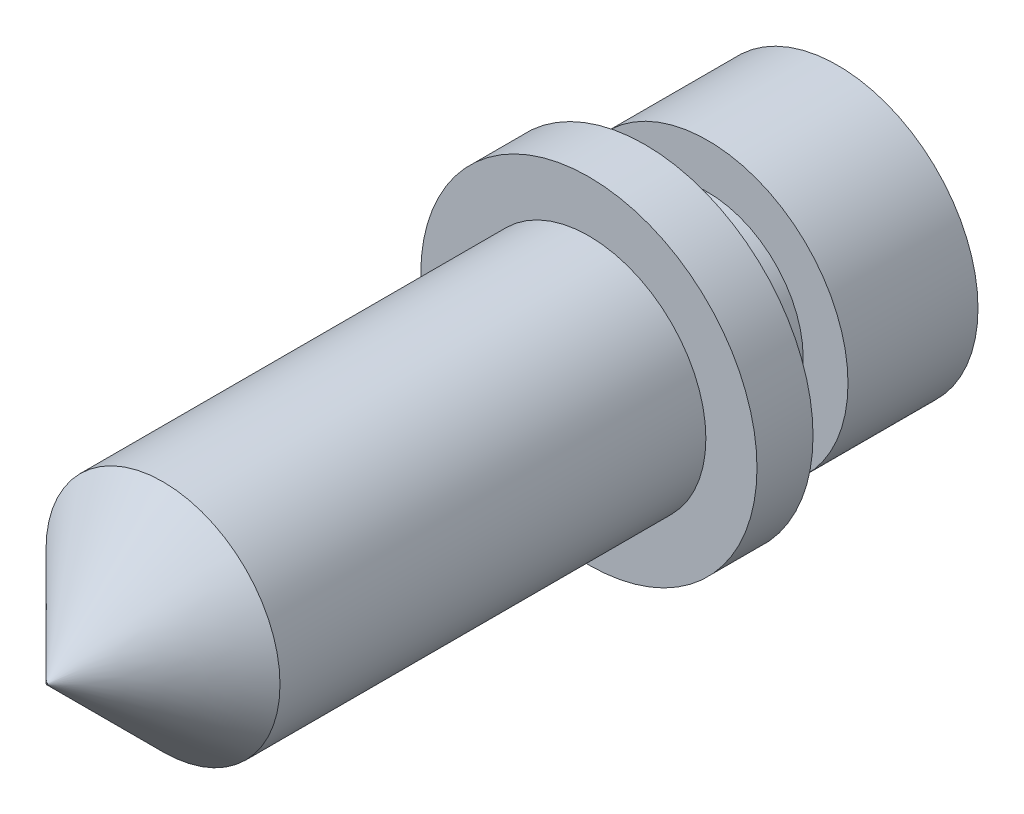
ISO-10303-21;
HEADER;
FILE_DESCRIPTION(('STEP AP214'),'2;1');
FILE_NAME('part.step','',(''),(''),'','','');
FILE_SCHEMA(('AUTOMOTIVE_DESIGN { 1 0 10303 214 1 1 1 1 }'));
ENDSEC;
DATA;
#1=APPLICATION_CONTEXT('core data for automotive mechanical design processes');
#2=APPLICATION_PROTOCOL_DEFINITION('international standard','automotive_design',2000,#1);
#3=PRODUCT_CONTEXT('',#1,'mechanical');
#4=PRODUCT('Part','Part','',(#3));
#5=PRODUCT_RELATED_PRODUCT_CATEGORY('part','',(#4));
#6=PRODUCT_DEFINITION_FORMATION('','',#4);
#7=PRODUCT_DEFINITION_CONTEXT('part definition',#1,'design');
#8=PRODUCT_DEFINITION('design','',#6,#7);
#9=PRODUCT_DEFINITION_SHAPE('','',#8);
#10=(LENGTH_UNIT() NAMED_UNIT(*) SI_UNIT(.MILLI.,.METRE.));
#11=(NAMED_UNIT(*) PLANE_ANGLE_UNIT() SI_UNIT($,.RADIAN.));
#12=(NAMED_UNIT(*) SI_UNIT($,.STERADIAN.) SOLID_ANGLE_UNIT());
#13=UNCERTAINTY_MEASURE_WITH_UNIT(LENGTH_MEASURE(1.E-05),#10,'distance_accuracy_value','');
#14=(GEOMETRIC_REPRESENTATION_CONTEXT(3) GLOBAL_UNCERTAINTY_ASSIGNED_CONTEXT((#13)) GLOBAL_UNIT_ASSIGNED_CONTEXT((#10,
#11,#12)) REPRESENTATION_CONTEXT('',''));
#15=CARTESIAN_POINT('',(0.,0.,0.));
#16=DIRECTION('',(0.,0.,1.));
#17=DIRECTION('',(1.,0.,0.));
#18=AXIS2_PLACEMENT_3D('',#15,#16,#17);
#19=CARTESIAN_POINT('',(0.,0.,12.85875));
#20=DIRECTION('',(0.,0.,-1.));
#21=DIRECTION('',(-1.,0.,0.));
#22=AXIS2_PLACEMENT_3D('',#19,#20,#21);
#23=CONICAL_SURFACE('',#22,3.3147,0.785398163397453);
#24=CARTESIAN_POINT('',(0.,0.,12.85875));
#25=DIRECTION('',(0.,0.,1.));
#26=DIRECTION('',(1.,0.,0.));
#27=AXIS2_PLACEMENT_3D('',#24,#25,#26);
#28=CIRCLE('',#27,3.3147);
#29=CARTESIAN_POINT('',(3.3147,0.,12.85875));
#30=VERTEX_POINT('',#29);
#31=EDGE_CURVE('E48',#30,#30,#28,.T.);
#32=ORIENTED_EDGE('',*,*,#31,.T.);
#33=EDGE_LOOP('',(#32));
#34=FACE_BOUND('',#33,.T.);
#35=CARTESIAN_POINT('',(0.,0.,16.14805));
#36=DIRECTION('',(0.,0.,1.));
#37=DIRECTION('',(1.,0.,0.));
#38=AXIS2_PLACEMENT_3D('',#35,#36,#37);
#39=CIRCLE('',#38,0.0253999999999992);
#40=CARTESIAN_POINT('',(0.0253999999999992,0.,16.14805));
#41=VERTEX_POINT('',#40);
#42=EDGE_CURVE('E35',#41,#41,#39,.F.);
#43=ORIENTED_EDGE('',*,*,#42,.T.);
#44=EDGE_LOOP('',(#43));
#45=FACE_BOUND('',#44,.T.);
#46=ADVANCED_FACE('F31',(#34,#45),#23,.T.);
#47=CARTESIAN_POINT('',(0.,0.,0.79375));
#48=DIRECTION('',(0.,0.,1.));
#49=DIRECTION('',(1.,0.,0.));
#50=AXIS2_PLACEMENT_3D('',#47,#48,#49);
#51=PLANE('',#50);
#52=CARTESIAN_POINT('',(0.,0.,0.79375));
#53=DIRECTION('',(0.,0.,1.));
#54=DIRECTION('',(1.,0.,0.));
#55=AXIS2_PLACEMENT_3D('',#52,#53,#54);
#56=CIRCLE('',#55,4.7625);
#57=CARTESIAN_POINT('',(4.7625,0.,0.79375));
#58=VERTEX_POINT('',#57);
#59=EDGE_CURVE('E10',#58,#58,#56,.T.);
#60=ORIENTED_EDGE('',*,*,#59,.T.);
#61=EDGE_LOOP('',(#60));
#62=FACE_BOUND('',#61,.T.);
#63=CARTESIAN_POINT('',(0.,0.,0.79375));
#64=DIRECTION('',(0.,0.,1.));
#65=DIRECTION('',(1.,0.,0.));
#66=AXIS2_PLACEMENT_3D('',#63,#64,#65);
#67=CIRCLE('',#66,3.3147);
#68=CARTESIAN_POINT('',(3.3147,0.,0.79375));
#69=VERTEX_POINT('',#68);
#70=EDGE_CURVE('E49',#69,#69,#67,.T.);
#71=ORIENTED_EDGE('',*,*,#70,.F.);
#72=EDGE_LOOP('',(#71));
#73=FACE_BOUND('',#72,.T.);
#74=ADVANCED_FACE('F89',(#62,#73),#51,.T.);
#75=CARTESIAN_POINT('',(0.,0.,-0.79375));
#76=DIRECTION('',(0.,0.,1.));
#77=DIRECTION('',(1.,0.,0.));
#78=AXIS2_PLACEMENT_3D('',#75,#76,#77);
#79=PLANE('',#78);
#80=CARTESIAN_POINT('',(0.,0.,-0.79375));
#81=DIRECTION('',(0.,0.,1.));
#82=DIRECTION('',(1.,0.,0.));
#83=AXIS2_PLACEMENT_3D('',#80,#81,#82);
#84=CIRCLE('',#83,4.7625);
#85=CARTESIAN_POINT('',(4.7625,0.,-0.79375));
#86=VERTEX_POINT('',#85);
#87=EDGE_CURVE('E39',#86,#86,#84,.T.);
#88=ORIENTED_EDGE('',*,*,#87,.F.);
#89=EDGE_LOOP('',(#88));
#90=FACE_BOUND('',#89,.T.);
#91=CARTESIAN_POINT('',(0.,0.,-0.79375));
#92=DIRECTION('',(0.,0.,1.));
#93=DIRECTION('',(1.,0.,0.));
#94=AXIS2_PLACEMENT_3D('',#91,#92,#93);
#95=CIRCLE('',#94,2.7051);
#96=CARTESIAN_POINT('',(2.7051,0.,-0.79375));
#97=VERTEX_POINT('',#96);
#98=EDGE_CURVE('E66',#97,#97,#95,.T.);
#99=ORIENTED_EDGE('',*,*,#98,.T.);
#100=EDGE_LOOP('',(#99));
#101=FACE_BOUND('',#100,.T.);
#102=ADVANCED_FACE('F95',(#90,#101),#79,.F.);
#103=CARTESIAN_POINT('',(0.,0.,0.79375));
#104=DIRECTION('',(0.,0.,-1.));
#105=DIRECTION('',(-1.,0.,0.));
#106=AXIS2_PLACEMENT_3D('',#103,#104,#105);
#107=CYLINDRICAL_SURFACE('',#106,4.7625);
#108=ORIENTED_EDGE('',*,*,#59,.F.);
#109=EDGE_LOOP('',(#108));
#110=FACE_BOUND('',#109,.T.);
#111=ORIENTED_EDGE('',*,*,#87,.T.);
#112=EDGE_LOOP('',(#111));
#113=FACE_BOUND('',#112,.T.);
#114=ADVANCED_FACE('F33',(#110,#113),#107,.T.);
#115=CARTESIAN_POINT('',(0.,0.,12.85875));
#116=DIRECTION('',(0.,0.,-1.));
#117=DIRECTION('',(-1.,0.,0.));
#118=AXIS2_PLACEMENT_3D('',#115,#116,#117);
#119=CYLINDRICAL_SURFACE('',#118,3.3147);
#120=ORIENTED_EDGE('',*,*,#31,.F.);
#121=EDGE_LOOP('',(#120));
#122=FACE_BOUND('',#121,.T.);
#123=ORIENTED_EDGE('',*,*,#70,.T.);
#124=EDGE_LOOP('',(#123));
#125=FACE_BOUND('',#124,.T.);
#126=ADVANCED_FACE('F102',(#122,#125),#119,.T.);
#127=CARTESIAN_POINT('',(-3.9751,0.,-2.57175));
#128=DIRECTION('',(0.,0.,1.));
#129=DIRECTION('',(1.,0.,0.));
#130=AXIS2_PLACEMENT_3D('',#127,#128,#129);
#131=PLANE('',#130);
#132=CARTESIAN_POINT('',(0.,0.,-2.57175));
#133=DIRECTION('',(0.,0.,1.));
#134=DIRECTION('',(1.,0.,0.));
#135=AXIS2_PLACEMENT_3D('',#132,#133,#134);
#136=CIRCLE('',#135,3.9751);
#137=CARTESIAN_POINT('',(3.9751,0.,-2.57175));
#138=VERTEX_POINT('',#137);
#139=EDGE_CURVE('E58',#138,#138,#136,.T.);
#140=ORIENTED_EDGE('',*,*,#139,.T.);
#141=EDGE_LOOP('',(#140));
#142=FACE_BOUND('',#141,.T.);
#143=CARTESIAN_POINT('',(0.,0.,-2.57175));
#144=DIRECTION('',(0.,0.,1.));
#145=DIRECTION('',(1.,0.,0.));
#146=AXIS2_PLACEMENT_3D('',#143,#144,#145);
#147=CIRCLE('',#146,2.7051);
#148=CARTESIAN_POINT('',(2.7051,0.,-2.57175));
#149=VERTEX_POINT('',#148);
#150=EDGE_CURVE('E63',#149,#149,#147,.T.);
#151=ORIENTED_EDGE('',*,*,#150,.F.);
#152=EDGE_LOOP('',(#151));
#153=FACE_BOUND('',#152,.T.);
#154=ADVANCED_FACE('F105',(#142,#153),#131,.T.);
#155=CARTESIAN_POINT('',(0.,0.,0.));
#156=DIRECTION('',(0.,0.,1.));
#157=DIRECTION('',(1.,0.,0.));
#158=AXIS2_PLACEMENT_3D('',#155,#156,#157);
#159=CYLINDRICAL_SURFACE('',#158,2.7051);
#160=ORIENTED_EDGE('',*,*,#150,.T.);
#161=EDGE_LOOP('',(#160));
#162=FACE_BOUND('',#161,.T.);
#163=ORIENTED_EDGE('',*,*,#98,.F.);
#164=EDGE_LOOP('',(#163));
#165=FACE_BOUND('',#164,.T.);
#166=ADVANCED_FACE('F123',(#162,#165),#159,.T.);
#167=CARTESIAN_POINT('',(0.,0.,12.79525));
#168=DIRECTION('',(0.,0.,-1.));
#169=DIRECTION('',(-1.,0.,0.));
#170=AXIS2_PLACEMENT_3D('',#167,#168,#169);
#171=PLANE('',#170);
#172=CARTESIAN_POINT('',(0.,0.,12.79525));
#173=DIRECTION('',(0.,0.,-1.));
#174=DIRECTION('',(-1.,0.,0.));
#175=AXIS2_PLACEMENT_3D('',#172,#173,#174);
#176=CIRCLE('',#175,0.0200000000000001);
#177=CARTESIAN_POINT('',(-0.0200000000000001,0.,12.79525));
#178=VERTEX_POINT('',#177);
#179=EDGE_CURVE('E69',#178,#178,#176,.T.);
#180=ORIENTED_EDGE('',*,*,#179,.F.);
#181=EDGE_LOOP('',(#180));
#182=FACE_BOUND('',#181,.T.);
#183=CARTESIAN_POINT('',(0.,0.,12.79525));
#184=DIRECTION('',(0.,0.,-1.));
#185=DIRECTION('',(-1.,0.,0.));
#186=AXIS2_PLACEMENT_3D('',#183,#184,#185);
#187=CIRCLE('',#186,1.5875);
#188=CARTESIAN_POINT('',(-1.5875,0.,12.79525));
#189=VERTEX_POINT('',#188);
#190=EDGE_CURVE('E52',#189,#189,#187,.T.);
#191=ORIENTED_EDGE('',*,*,#190,.T.);
#192=EDGE_LOOP('',(#191));
#193=FACE_BOUND('',#192,.T.);
#194=ADVANCED_FACE('F125',(#182,#193),#171,.T.);
#195=CARTESIAN_POINT('',(0.,0.,12.79525));
#196=DIRECTION('',(0.,0.,-1.));
#197=DIRECTION('',(-1.,0.,0.));
#198=AXIS2_PLACEMENT_3D('',#195,#196,#197);
#199=CYLINDRICAL_SURFACE('',#198,1.5875);
#200=ORIENTED_EDGE('',*,*,#190,.F.);
#201=EDGE_LOOP('',(#200));
#202=FACE_BOUND('',#201,.T.);
#203=CARTESIAN_POINT('',(0.,0.,-6.25475));
#204=DIRECTION('',(0.,0.,-1.));
#205=DIRECTION('',(-1.,0.,0.));
#206=AXIS2_PLACEMENT_3D('',#203,#204,#205);
#207=CIRCLE('',#206,1.5875);
#208=CARTESIAN_POINT('',(-1.5875,0.,-6.25475));
#209=VERTEX_POINT('',#208);
#210=EDGE_CURVE('E55',#209,#209,#207,.T.);
#211=ORIENTED_EDGE('',*,*,#210,.T.);
#212=EDGE_LOOP('',(#211));
#213=FACE_BOUND('',#212,.T.);
#214=ADVANCED_FACE('F100',(#202,#213),#199,.F.);
#215=CARTESIAN_POINT('',(0.,0.,-6.25475));
#216=DIRECTION('',(0.,0.,-1.));
#217=DIRECTION('',(-1.,0.,0.));
#218=AXIS2_PLACEMENT_3D('',#215,#216,#217);
#219=PLANE('',#218);
#220=ORIENTED_EDGE('',*,*,#210,.F.);
#221=EDGE_LOOP('',(#220));
#222=FACE_BOUND('',#221,.T.);
#223=CARTESIAN_POINT('',(0.,0.,-6.25475));
#224=DIRECTION('',(0.,0.,-1.));
#225=DIRECTION('',(-1.,0.,0.));
#226=AXIS2_PLACEMENT_3D('',#223,#224,#225);
#227=CIRCLE('',#226,3.9751);
#228=CARTESIAN_POINT('',(-3.9751,0.,-6.25475));
#229=VERTEX_POINT('',#228);
#230=EDGE_CURVE('E44',#229,#229,#227,.T.);
#231=ORIENTED_EDGE('',*,*,#230,.T.);
#232=EDGE_LOOP('',(#231));
#233=FACE_BOUND('',#232,.T.);
#234=ADVANCED_FACE('F107',(#222,#233),#219,.T.);
#235=CARTESIAN_POINT('',(0.,0.,-6.25475));
#236=DIRECTION('',(0.,0.,1.));
#237=DIRECTION('',(1.,0.,0.));
#238=AXIS2_PLACEMENT_3D('',#235,#236,#237);
#239=CYLINDRICAL_SURFACE('',#238,3.9751);
#240=ORIENTED_EDGE('',*,*,#230,.F.);
#241=EDGE_LOOP('',(#240));
#242=FACE_BOUND('',#241,.T.);
#243=ORIENTED_EDGE('',*,*,#139,.F.);
#244=EDGE_LOOP('',(#243));
#245=FACE_BOUND('',#244,.T.);
#246=ADVANCED_FACE('F86',(#242,#245),#239,.T.);
#247=CARTESIAN_POINT('',(0.,0.,16.14805));
#248=DIRECTION('',(0.,0.,1.));
#249=DIRECTION('',(1.,0.,0.));
#250=AXIS2_PLACEMENT_3D('',#247,#248,#249);
#251=PLANE('',#250);
#252=CARTESIAN_POINT('',(0.,0.,16.14805));
#253=DIRECTION('',(0.,0.,-1.));
#254=DIRECTION('',(-1.,0.,0.));
#255=AXIS2_PLACEMENT_3D('',#252,#253,#254);
#256=CIRCLE('',#255,0.0200000000000001);
#257=CARTESIAN_POINT('',(-0.0200000000000001,0.,16.14805));
#258=VERTEX_POINT('',#257);
#259=EDGE_CURVE('E72',#258,#258,#256,.T.);
#260=ORIENTED_EDGE('',*,*,#259,.T.);
#261=EDGE_LOOP('',(#260));
#262=FACE_BOUND('',#261,.T.);
#263=ORIENTED_EDGE('',*,*,#42,.F.);
#264=EDGE_LOOP('',(#263));
#265=FACE_BOUND('',#264,.T.);
#266=ADVANCED_FACE('F76',(#262,#265),#251,.T.);
#267=CARTESIAN_POINT('',(0.,0.,16.14805));
#268=DIRECTION('',(0.,0.,-1.));
#269=DIRECTION('',(-1.,0.,0.));
#270=AXIS2_PLACEMENT_3D('',#267,#268,#269);
#271=CYLINDRICAL_SURFACE('',#270,0.0200000000000001);
#272=ORIENTED_EDGE('',*,*,#179,.T.);
#273=EDGE_LOOP('',(#272));
#274=FACE_BOUND('',#273,.T.);
#275=ORIENTED_EDGE('',*,*,#259,.F.);
#276=EDGE_LOOP('',(#275));
#277=FACE_BOUND('',#276,.T.);
#278=ADVANCED_FACE('F79',(#274,#277),#271,.F.);
#279=CLOSED_SHELL('',(#46,#74,#102,#114,#126,#154,#166,#194,#214,#234,#246,#266,#278));
#280=MANIFOLD_SOLID_BREP('B2',#279);
#281=ADVANCED_BREP_SHAPE_REPRESENTATION('',(#18,#280),#14);
#282=SHAPE_DEFINITION_REPRESENTATION(#9,#281);
ENDSEC;
END-ISO-10303-21;
